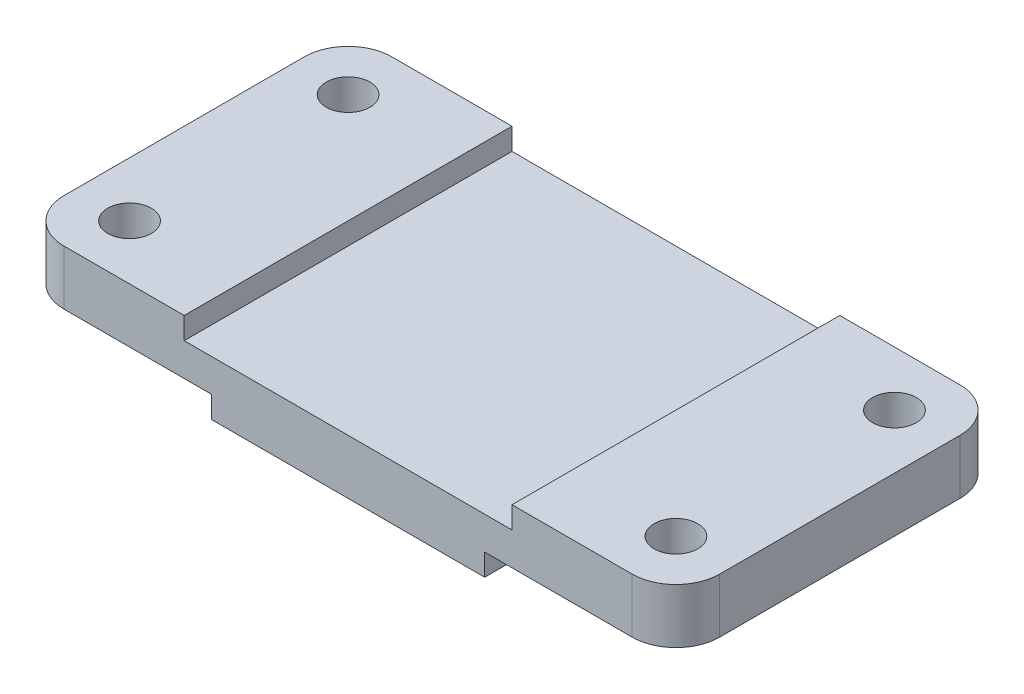
ISO-10303-21;
HEADER;
FILE_DESCRIPTION(('STEP AP214'),'2;1');
FILE_NAME('part.step','',(''),(''),'','','');
FILE_SCHEMA(('AUTOMOTIVE_DESIGN { 1 0 10303 214 1 1 1 1 }'));
ENDSEC;
DATA;
#1=APPLICATION_CONTEXT('core data for automotive mechanical design processes');
#2=APPLICATION_PROTOCOL_DEFINITION('international standard','automotive_design',2000,#1);
#3=PRODUCT_CONTEXT('',#1,'mechanical');
#4=PRODUCT('Part','Part','',(#3));
#5=PRODUCT_RELATED_PRODUCT_CATEGORY('part','',(#4));
#6=PRODUCT_DEFINITION_FORMATION('','',#4);
#7=PRODUCT_DEFINITION_CONTEXT('part definition',#1,'design');
#8=PRODUCT_DEFINITION('design','',#6,#7);
#9=PRODUCT_DEFINITION_SHAPE('','',#8);
#10=(LENGTH_UNIT() NAMED_UNIT(*) SI_UNIT(.MILLI.,.METRE.));
#11=(NAMED_UNIT(*) PLANE_ANGLE_UNIT() SI_UNIT($,.RADIAN.));
#12=(NAMED_UNIT(*) SI_UNIT($,.STERADIAN.) SOLID_ANGLE_UNIT());
#13=UNCERTAINTY_MEASURE_WITH_UNIT(LENGTH_MEASURE(1.E-05),#10,'distance_accuracy_value','');
#14=(GEOMETRIC_REPRESENTATION_CONTEXT(3) GLOBAL_UNCERTAINTY_ASSIGNED_CONTEXT((#13)) GLOBAL_UNIT_ASSIGNED_CONTEXT((#10,
#11,#12)) REPRESENTATION_CONTEXT('',''));
#15=CARTESIAN_POINT('',(0.,0.,0.));
#16=DIRECTION('',(0.,0.,1.));
#17=DIRECTION('',(1.,0.,0.));
#18=AXIS2_PLACEMENT_3D('',#15,#16,#17);
#19=CARTESIAN_POINT('',(0.,0.,0.));
#20=DIRECTION('',(0.,-1.,0.));
#21=DIRECTION('',(0.,0.,-1.));
#22=AXIS2_PLACEMENT_3D('',#19,#20,#21);
#23=PLANE('',#22);
#24=CARTESIAN_POINT('',(69.85,0.,-6.35));
#25=DIRECTION('',(0.,-1.,0.));
#26=DIRECTION('',(0.,0.,-1.));
#27=AXIS2_PLACEMENT_3D('',#24,#25,#26);
#28=CIRCLE('',#27,2.54);
#29=CARTESIAN_POINT('',(69.85,0.,-8.89));
#30=VERTEX_POINT('',#29);
#31=EDGE_CURVE('E308',#30,#30,#28,.T.);
#32=ORIENTED_EDGE('',*,*,#31,.F.);
#33=EDGE_LOOP('',(#32));
#34=FACE_BOUND('',#33,.T.);
#35=CARTESIAN_POINT('',(69.85,0.,-31.75));
#36=DIRECTION('',(0.,-1.,0.));
#37=DIRECTION('',(0.,0.,-1.));
#38=AXIS2_PLACEMENT_3D('',#35,#36,#37);
#39=CIRCLE('',#38,2.54);
#40=CARTESIAN_POINT('',(69.85,0.,-34.29));
#41=VERTEX_POINT('',#40);
#42=EDGE_CURVE('E312',#41,#41,#39,.T.);
#43=ORIENTED_EDGE('',*,*,#42,.F.);
#44=EDGE_LOOP('',(#43));
#45=FACE_BOUND('',#44,.T.);
#46=DIRECTION('',(0.,0.,-1.));
#47=VECTOR('',#46,1.);
#48=CARTESIAN_POINT('',(76.2,0.,-38.1));
#49=LINE('',#48,#47);
#50=CARTESIAN_POINT('',(76.2,0.,-5.08000000000002));
#51=VERTEX_POINT('',#50);
#52=CARTESIAN_POINT('',(76.2,0.,-33.02));
#53=VERTEX_POINT('',#52);
#54=EDGE_CURVE('E219',#51,#53,#49,.T.);
#55=ORIENTED_EDGE('',*,*,#54,.F.);
#56=CARTESIAN_POINT('',(71.12,0.,-5.08000000000001));
#57=DIRECTION('',(0.,-1.,0.));
#58=DIRECTION('',(0.,0.,-1.));
#59=AXIS2_PLACEMENT_3D('',#56,#57,#58);
#60=CIRCLE('',#59,5.08);
#61=CARTESIAN_POINT('',(71.12,0.,0.));
#62=VERTEX_POINT('',#61);
#63=EDGE_CURVE('E267',#51,#62,#60,.T.);
#64=ORIENTED_EDGE('',*,*,#63,.T.);
#65=DIRECTION('',(1.,0.,0.));
#66=VECTOR('',#65,1.);
#67=CARTESIAN_POINT('',(76.2,0.,0.));
#68=LINE('',#67,#66);
#69=CARTESIAN_POINT('',(53.975,0.,0.));
#70=VERTEX_POINT('',#69);
#71=EDGE_CURVE('E287',#70,#62,#68,.T.);
#72=ORIENTED_EDGE('',*,*,#71,.F.);
#73=DIRECTION('',(0.,0.,1.));
#74=VECTOR('',#73,1.);
#75=CARTESIAN_POINT('',(53.975,0.,-38.1));
#76=LINE('',#75,#74);
#77=CARTESIAN_POINT('',(53.975,0.,-38.1));
#78=VERTEX_POINT('',#77);
#79=EDGE_CURVE('E166',#78,#70,#76,.T.);
#80=ORIENTED_EDGE('',*,*,#79,.F.);
#81=DIRECTION('',(-1.,0.,0.));
#82=VECTOR('',#81,1.);
#83=CARTESIAN_POINT('',(0.,0.,-38.1));
#84=LINE('',#83,#82);
#85=CARTESIAN_POINT('',(71.12,0.,-38.1));
#86=VERTEX_POINT('',#85);
#87=EDGE_CURVE('E243',#86,#78,#84,.T.);
#88=ORIENTED_EDGE('',*,*,#87,.F.);
#89=CARTESIAN_POINT('',(71.12,0.,-33.02));
#90=DIRECTION('',(0.,-1.,0.));
#91=DIRECTION('',(0.,0.,-1.));
#92=AXIS2_PLACEMENT_3D('',#89,#90,#91);
#93=CIRCLE('',#92,5.08);
#94=EDGE_CURVE('E265',#86,#53,#93,.T.);
#95=ORIENTED_EDGE('',*,*,#94,.T.);
#96=EDGE_LOOP('',(#55,#64,#72,#80,#88,#95));
#97=FACE_BOUND('',#96,.T.);
#98=ADVANCED_FACE('F33',(#34,#45,#97),#23,.T.);
#99=CARTESIAN_POINT('',(0.,6.35,-38.1));
#100=DIRECTION('',(0.,0.,1.));
#101=DIRECTION('',(1.,0.,0.));
#102=AXIS2_PLACEMENT_3D('',#99,#100,#101);
#103=PLANE('',#102);
#104=CARTESIAN_POINT('',(22.225,0.,-38.1));
#105=VERTEX_POINT('',#104);
#106=CARTESIAN_POINT('',(5.08,0.,-38.1));
#107=VERTEX_POINT('',#106);
#108=EDGE_CURVE('E233',#105,#107,#84,.T.);
#109=ORIENTED_EDGE('',*,*,#108,.T.);
#110=DIRECTION('',(0.,-1.,0.));
#111=VECTOR('',#110,1.);
#112=CARTESIAN_POINT('',(5.08,6.35,-38.1));
#113=LINE('',#112,#111);
#114=CARTESIAN_POINT('',(5.08,6.35,-38.1));
#115=VERTEX_POINT('',#114);
#116=EDGE_CURVE('E251',#107,#115,#113,.F.);
#117=ORIENTED_EDGE('',*,*,#116,.T.);
#118=DIRECTION('',(-1.,0.,0.));
#119=VECTOR('',#118,1.);
#120=CARTESIAN_POINT('',(0.,6.35,-38.1));
#121=LINE('',#120,#119);
#122=CARTESIAN_POINT('',(19.05,6.35,-38.1));
#123=VERTEX_POINT('',#122);
#124=EDGE_CURVE('E222',#123,#115,#121,.T.);
#125=ORIENTED_EDGE('',*,*,#124,.F.);
#126=DIRECTION('',(0.,1.,0.));
#127=VECTOR('',#126,1.);
#128=CARTESIAN_POINT('',(19.05,3.81,-38.1));
#129=LINE('',#128,#127);
#130=CARTESIAN_POINT('',(19.05,3.81,-38.1));
#131=VERTEX_POINT('',#130);
#132=EDGE_CURVE('E214',#131,#123,#129,.T.);
#133=ORIENTED_EDGE('',*,*,#132,.F.);
#134=DIRECTION('',(1.,0.,0.));
#135=VECTOR('',#134,1.);
#136=CARTESIAN_POINT('',(19.05,3.81,-38.1));
#137=LINE('',#136,#135);
#138=CARTESIAN_POINT('',(57.15,3.81,-38.1));
#139=VERTEX_POINT('',#138);
#140=EDGE_CURVE('E202',#131,#139,#137,.T.);
#141=ORIENTED_EDGE('',*,*,#140,.T.);
#142=DIRECTION('',(0.,1.,0.));
#143=VECTOR('',#142,1.);
#144=CARTESIAN_POINT('',(57.15,3.81,-38.1));
#145=LINE('',#144,#143);
#146=CARTESIAN_POINT('',(57.15,6.35,-38.1));
#147=VERTEX_POINT('',#146);
#148=EDGE_CURVE('E211',#139,#147,#145,.T.);
#149=ORIENTED_EDGE('',*,*,#148,.T.);
#150=CARTESIAN_POINT('',(71.12,6.35,-38.1));
#151=VERTEX_POINT('',#150);
#152=EDGE_CURVE('E223',#151,#147,#121,.T.);
#153=ORIENTED_EDGE('',*,*,#152,.F.);
#154=DIRECTION('',(0.,-1.,0.));
#155=VECTOR('',#154,1.);
#156=CARTESIAN_POINT('',(71.12,6.35,-38.1));
#157=LINE('',#156,#155);
#158=EDGE_CURVE('E248',#151,#86,#157,.T.);
#159=ORIENTED_EDGE('',*,*,#158,.T.);
#160=ORIENTED_EDGE('',*,*,#87,.T.);
#161=DIRECTION('',(0.,1.,0.));
#162=VECTOR('',#161,1.);
#163=CARTESIAN_POINT('',(53.975,-2.54,-38.1));
#164=LINE('',#163,#162);
#165=CARTESIAN_POINT('',(53.975,-2.54,-38.1));
#166=VERTEX_POINT('',#165);
#167=EDGE_CURVE('E179',#166,#78,#164,.T.);
#168=ORIENTED_EDGE('',*,*,#167,.F.);
#169=DIRECTION('',(1.,0.,0.));
#170=VECTOR('',#169,1.);
#171=CARTESIAN_POINT('',(22.225,-2.54,-38.1));
#172=LINE('',#171,#170);
#173=CARTESIAN_POINT('',(22.225,-2.54,-38.1));
#174=VERTEX_POINT('',#173);
#175=EDGE_CURVE('E156',#174,#166,#172,.T.);
#176=ORIENTED_EDGE('',*,*,#175,.F.);
#177=DIRECTION('',(0.,1.,0.));
#178=VECTOR('',#177,1.);
#179=CARTESIAN_POINT('',(22.225,-2.54,-38.1));
#180=LINE('',#179,#178);
#181=EDGE_CURVE('E153',#174,#105,#180,.T.);
#182=ORIENTED_EDGE('',*,*,#181,.T.);
#183=EDGE_LOOP('',(#109,#117,#125,#133,#141,#149,#153,#159,#160,#168,#176,#182));
#184=FACE_BOUND('',#183,.T.);
#185=ADVANCED_FACE('F276',(#184),#103,.F.);
#186=CARTESIAN_POINT('',(76.2,6.35,0.));
#187=DIRECTION('',(0.,0.,-1.));
#188=DIRECTION('',(-1.,0.,0.));
#189=AXIS2_PLACEMENT_3D('',#186,#187,#188);
#190=PLANE('',#189);
#191=DIRECTION('',(1.,0.,0.));
#192=VECTOR('',#191,1.);
#193=CARTESIAN_POINT('',(76.2,6.35,0.));
#194=LINE('',#193,#192);
#195=CARTESIAN_POINT('',(5.08000000000003,6.35,0.));
#196=VERTEX_POINT('',#195);
#197=CARTESIAN_POINT('',(19.05,6.35,0.));
#198=VERTEX_POINT('',#197);
#199=EDGE_CURVE('E229',#196,#198,#194,.T.);
#200=ORIENTED_EDGE('',*,*,#199,.F.);
#201=DIRECTION('',(0.,-1.,0.));
#202=VECTOR('',#201,1.);
#203=CARTESIAN_POINT('',(5.08,6.35,0.));
#204=LINE('',#203,#202);
#205=CARTESIAN_POINT('',(5.08000000000003,0.,0.));
#206=VERTEX_POINT('',#205);
#207=EDGE_CURVE('E259',#196,#206,#204,.T.);
#208=ORIENTED_EDGE('',*,*,#207,.T.);
#209=CARTESIAN_POINT('',(22.225,0.,0.));
#210=VERTEX_POINT('',#209);
#211=EDGE_CURVE('E172',#206,#210,#68,.T.);
#212=ORIENTED_EDGE('',*,*,#211,.T.);
#213=DIRECTION('',(0.,1.,0.));
#214=VECTOR('',#213,1.);
#215=CARTESIAN_POINT('',(22.225,-2.54,0.));
#216=LINE('',#215,#214);
#217=CARTESIAN_POINT('',(22.225,-2.54,0.));
#218=VERTEX_POINT('',#217);
#219=EDGE_CURVE('E151',#218,#210,#216,.T.);
#220=ORIENTED_EDGE('',*,*,#219,.F.);
#221=DIRECTION('',(-1.,0.,0.));
#222=VECTOR('',#221,1.);
#223=CARTESIAN_POINT('',(53.975,-2.54,0.));
#224=LINE('',#223,#222);
#225=CARTESIAN_POINT('',(53.975,-2.54,0.));
#226=VERTEX_POINT('',#225);
#227=EDGE_CURVE('E157',#226,#218,#224,.T.);
#228=ORIENTED_EDGE('',*,*,#227,.F.);
#229=DIRECTION('',(0.,1.,0.));
#230=VECTOR('',#229,1.);
#231=CARTESIAN_POINT('',(53.975,-2.54,0.));
#232=LINE('',#231,#230);
#233=EDGE_CURVE('E190',#226,#70,#232,.T.);
#234=ORIENTED_EDGE('',*,*,#233,.T.);
#235=ORIENTED_EDGE('',*,*,#71,.T.);
#236=DIRECTION('',(0.,-1.,0.));
#237=VECTOR('',#236,1.);
#238=CARTESIAN_POINT('',(71.12,6.35,0.));
#239=LINE('',#238,#237);
#240=CARTESIAN_POINT('',(71.12,6.35,0.));
#241=VERTEX_POINT('',#240);
#242=EDGE_CURVE('E257',#62,#241,#239,.F.);
#243=ORIENTED_EDGE('',*,*,#242,.T.);
#244=CARTESIAN_POINT('',(57.15,6.35,0.));
#245=VERTEX_POINT('',#244);
#246=EDGE_CURVE('E228',#245,#241,#194,.T.);
#247=ORIENTED_EDGE('',*,*,#246,.F.);
#248=DIRECTION('',(0.,1.,0.));
#249=VECTOR('',#248,1.);
#250=CARTESIAN_POINT('',(57.15,3.81,0.));
#251=LINE('',#250,#249);
#252=CARTESIAN_POINT('',(57.15,3.81,0.));
#253=VERTEX_POINT('',#252);
#254=EDGE_CURVE('E206',#253,#245,#251,.T.);
#255=ORIENTED_EDGE('',*,*,#254,.F.);
#256=DIRECTION('',(-1.,0.,0.));
#257=VECTOR('',#256,1.);
#258=CARTESIAN_POINT('',(57.15,3.81,0.));
#259=LINE('',#258,#257);
#260=CARTESIAN_POINT('',(19.05,3.81,0.));
#261=VERTEX_POINT('',#260);
#262=EDGE_CURVE('E197',#253,#261,#259,.T.);
#263=ORIENTED_EDGE('',*,*,#262,.T.);
#264=DIRECTION('',(0.,1.,0.));
#265=VECTOR('',#264,1.);
#266=CARTESIAN_POINT('',(19.05,3.81,0.));
#267=LINE('',#266,#265);
#268=EDGE_CURVE('E216',#261,#198,#267,.T.);
#269=ORIENTED_EDGE('',*,*,#268,.T.);
#270=EDGE_LOOP('',(#200,#208,#212,#220,#228,#234,#235,#243,#247,#255,#263,#269));
#271=FACE_BOUND('',#270,.T.);
#272=ADVANCED_FACE('F169',(#271),#190,.F.);
#273=CARTESIAN_POINT('',(0.,6.35,0.));
#274=DIRECTION('',(0.,-1.,0.));
#275=DIRECTION('',(0.,0.,-1.));
#276=AXIS2_PLACEMENT_3D('',#273,#274,#275);
#277=PLANE('',#276);
#278=CARTESIAN_POINT('',(6.35,6.35,-6.35));
#279=DIRECTION('',(0.,-1.,0.));
#280=DIRECTION('',(0.,0.,-1.));
#281=AXIS2_PLACEMENT_3D('',#278,#279,#280);
#282=CIRCLE('',#281,2.54);
#283=CARTESIAN_POINT('',(6.35,6.35,-8.89));
#284=VERTEX_POINT('',#283);
#285=EDGE_CURVE('E316',#284,#284,#282,.T.);
#286=ORIENTED_EDGE('',*,*,#285,.T.);
#287=EDGE_LOOP('',(#286));
#288=FACE_BOUND('',#287,.T.);
#289=CARTESIAN_POINT('',(6.35,6.35,-31.75));
#290=DIRECTION('',(0.,-1.,0.));
#291=DIRECTION('',(0.,0.,-1.));
#292=AXIS2_PLACEMENT_3D('',#289,#290,#291);
#293=CIRCLE('',#292,2.54);
#294=CARTESIAN_POINT('',(6.35,6.35,-34.29));
#295=VERTEX_POINT('',#294);
#296=EDGE_CURVE('E320',#295,#295,#293,.T.);
#297=ORIENTED_EDGE('',*,*,#296,.T.);
#298=EDGE_LOOP('',(#297));
#299=FACE_BOUND('',#298,.T.);
#300=ORIENTED_EDGE('',*,*,#124,.T.);
#301=CARTESIAN_POINT('',(5.08,6.35,-33.02));
#302=DIRECTION('',(0.,-1.,0.));
#303=DIRECTION('',(0.,0.,-1.));
#304=AXIS2_PLACEMENT_3D('',#301,#302,#303);
#305=CIRCLE('',#304,5.08);
#306=CARTESIAN_POINT('',(0.,6.35,-33.02));
#307=VERTEX_POINT('',#306);
#308=EDGE_CURVE('E255',#115,#307,#305,.F.);
#309=ORIENTED_EDGE('',*,*,#308,.T.);
#310=DIRECTION('',(0.,0.,1.));
#311=VECTOR('',#310,1.);
#312=CARTESIAN_POINT('',(0.,6.35,0.));
#313=LINE('',#312,#311);
#314=CARTESIAN_POINT('',(0.,6.35,-5.08));
#315=VERTEX_POINT('',#314);
#316=EDGE_CURVE('E225',#307,#315,#313,.T.);
#317=ORIENTED_EDGE('',*,*,#316,.T.);
#318=CARTESIAN_POINT('',(5.08,6.35,-5.08));
#319=DIRECTION('',(0.,-1.,0.));
#320=DIRECTION('',(0.,0.,-1.));
#321=AXIS2_PLACEMENT_3D('',#318,#319,#320);
#322=CIRCLE('',#321,5.08);
#323=EDGE_CURVE('E253',#315,#196,#322,.F.);
#324=ORIENTED_EDGE('',*,*,#323,.T.);
#325=ORIENTED_EDGE('',*,*,#199,.T.);
#326=DIRECTION('',(0.,0.,-1.));
#327=VECTOR('',#326,1.);
#328=CARTESIAN_POINT('',(19.05,6.35,0.));
#329=LINE('',#328,#327);
#330=EDGE_CURVE('E174',#198,#123,#329,.T.);
#331=ORIENTED_EDGE('',*,*,#330,.T.);
#332=EDGE_LOOP('',(#300,#309,#317,#324,#325,#331));
#333=FACE_BOUND('',#332,.T.);
#334=ADVANCED_FACE('F355',(#288,#299,#333),#277,.F.);
#335=CARTESIAN_POINT('',(69.85,6.35,-6.35));
#336=DIRECTION('',(0.,-1.,0.));
#337=DIRECTION('',(0.,0.,-1.));
#338=AXIS2_PLACEMENT_3D('',#335,#336,#337);
#339=CIRCLE('',#338,2.54);
#340=CARTESIAN_POINT('',(69.85,6.35,-8.89));
#341=VERTEX_POINT('',#340);
#342=EDGE_CURVE('E305',#341,#341,#339,.T.);
#343=ORIENTED_EDGE('',*,*,#342,.T.);
#344=EDGE_LOOP('',(#343));
#345=FACE_BOUND('',#344,.T.);
#346=CARTESIAN_POINT('',(69.85,6.35,-31.75));
#347=DIRECTION('',(0.,-1.,0.));
#348=DIRECTION('',(0.,0.,-1.));
#349=AXIS2_PLACEMENT_3D('',#346,#347,#348);
#350=CIRCLE('',#349,2.54);
#351=CARTESIAN_POINT('',(69.85,6.35,-34.29));
#352=VERTEX_POINT('',#351);
#353=EDGE_CURVE('E309',#352,#352,#350,.T.);
#354=ORIENTED_EDGE('',*,*,#353,.T.);
#355=EDGE_LOOP('',(#354));
#356=FACE_BOUND('',#355,.T.);
#357=ORIENTED_EDGE('',*,*,#246,.T.);
#358=CARTESIAN_POINT('',(71.12,6.35,-5.08000000000001));
#359=DIRECTION('',(0.,-1.,0.));
#360=DIRECTION('',(0.,0.,-1.));
#361=AXIS2_PLACEMENT_3D('',#358,#359,#360);
#362=CIRCLE('',#361,5.08);
#363=CARTESIAN_POINT('',(76.2,6.35,-5.08000000000002));
#364=VERTEX_POINT('',#363);
#365=EDGE_CURVE('E11',#241,#364,#362,.F.);
#366=ORIENTED_EDGE('',*,*,#365,.T.);
#367=DIRECTION('',(0.,0.,-1.));
#368=VECTOR('',#367,1.);
#369=CARTESIAN_POINT('',(76.2,6.35,-38.1));
#370=LINE('',#369,#368);
#371=CARTESIAN_POINT('',(76.2,6.35,-33.02));
#372=VERTEX_POINT('',#371);
#373=EDGE_CURVE('E220',#364,#372,#370,.T.);
#374=ORIENTED_EDGE('',*,*,#373,.T.);
#375=CARTESIAN_POINT('',(71.12,6.35,-33.02));
#376=DIRECTION('',(0.,-1.,0.));
#377=DIRECTION('',(0.,0.,-1.));
#378=AXIS2_PLACEMENT_3D('',#375,#376,#377);
#379=CIRCLE('',#378,5.08);
#380=EDGE_CURVE('E41',#372,#151,#379,.F.);
#381=ORIENTED_EDGE('',*,*,#380,.T.);
#382=ORIENTED_EDGE('',*,*,#152,.T.);
#383=DIRECTION('',(0.,0.,1.));
#384=VECTOR('',#383,1.);
#385=CARTESIAN_POINT('',(57.15,6.35,-38.1));
#386=LINE('',#385,#384);
#387=EDGE_CURVE('E177',#147,#245,#386,.T.);
#388=ORIENTED_EDGE('',*,*,#387,.T.);
#389=EDGE_LOOP('',(#357,#366,#374,#381,#382,#388));
#390=FACE_BOUND('',#389,.T.);
#391=ADVANCED_FACE('F270',(#345,#356,#390),#277,.F.);
#392=CARTESIAN_POINT('',(76.2,6.35,-38.1));
#393=DIRECTION('',(-1.,0.,0.));
#394=DIRECTION('',(0.,0.,1.));
#395=AXIS2_PLACEMENT_3D('',#392,#393,#394);
#396=PLANE('',#395);
#397=ORIENTED_EDGE('',*,*,#373,.F.);
#398=DIRECTION('',(0.,-1.,0.));
#399=VECTOR('',#398,1.);
#400=CARTESIAN_POINT('',(76.2,6.35,-5.08000000000001));
#401=LINE('',#400,#399);
#402=EDGE_CURVE('E262',#364,#51,#401,.T.);
#403=ORIENTED_EDGE('',*,*,#402,.T.);
#404=ORIENTED_EDGE('',*,*,#54,.T.);
#405=DIRECTION('',(0.,-1.,0.));
#406=VECTOR('',#405,1.);
#407=CARTESIAN_POINT('',(76.2,6.35,-33.02));
#408=LINE('',#407,#406);
#409=EDGE_CURVE('E48',#53,#372,#408,.F.);
#410=ORIENTED_EDGE('',*,*,#409,.T.);
#411=EDGE_LOOP('',(#397,#403,#404,#410));
#412=FACE_BOUND('',#411,.T.);
#413=ADVANCED_FACE('F281',(#412),#396,.F.);
#414=CARTESIAN_POINT('',(0.,6.35,0.));
#415=DIRECTION('',(1.,0.,0.));
#416=DIRECTION('',(0.,0.,-1.));
#417=AXIS2_PLACEMENT_3D('',#414,#415,#416);
#418=PLANE('',#417);
#419=ORIENTED_EDGE('',*,*,#316,.F.);
#420=DIRECTION('',(0.,-1.,0.));
#421=VECTOR('',#420,1.);
#422=CARTESIAN_POINT('',(0.,6.35,-33.02));
#423=LINE('',#422,#421);
#424=CARTESIAN_POINT('',(0.,0.,-33.02));
#425=VERTEX_POINT('',#424);
#426=EDGE_CURVE('E294',#307,#425,#423,.T.);
#427=ORIENTED_EDGE('',*,*,#426,.T.);
#428=DIRECTION('',(0.,0.,1.));
#429=VECTOR('',#428,1.);
#430=CARTESIAN_POINT('',(0.,0.,0.));
#431=LINE('',#430,#429);
#432=CARTESIAN_POINT('',(0.,0.,-5.08));
#433=VERTEX_POINT('',#432);
#434=EDGE_CURVE('E236',#425,#433,#431,.T.);
#435=ORIENTED_EDGE('',*,*,#434,.T.);
#436=DIRECTION('',(0.,-1.,0.));
#437=VECTOR('',#436,1.);
#438=CARTESIAN_POINT('',(0.,6.35,-5.08));
#439=LINE('',#438,#437);
#440=EDGE_CURVE('E231',#433,#315,#439,.F.);
#441=ORIENTED_EDGE('',*,*,#440,.T.);
#442=EDGE_LOOP('',(#419,#427,#435,#441));
#443=FACE_BOUND('',#442,.T.);
#444=ADVANCED_FACE('F362',(#443),#418,.F.);
#445=CARTESIAN_POINT('',(6.35,0.,-6.35));
#446=DIRECTION('',(0.,-1.,0.));
#447=DIRECTION('',(0.,0.,-1.));
#448=AXIS2_PLACEMENT_3D('',#445,#446,#447);
#449=CIRCLE('',#448,2.54);
#450=CARTESIAN_POINT('',(6.35,0.,-8.89));
#451=VERTEX_POINT('',#450);
#452=EDGE_CURVE('E313',#451,#451,#449,.T.);
#453=ORIENTED_EDGE('',*,*,#452,.F.);
#454=EDGE_LOOP('',(#453));
#455=FACE_BOUND('',#454,.T.);
#456=CARTESIAN_POINT('',(6.35,0.,-31.75));
#457=DIRECTION('',(0.,-1.,0.));
#458=DIRECTION('',(0.,0.,-1.));
#459=AXIS2_PLACEMENT_3D('',#456,#457,#458);
#460=CIRCLE('',#459,2.54);
#461=CARTESIAN_POINT('',(6.35,0.,-34.29));
#462=VERTEX_POINT('',#461);
#463=EDGE_CURVE('E317',#462,#462,#460,.T.);
#464=ORIENTED_EDGE('',*,*,#463,.F.);
#465=EDGE_LOOP('',(#464));
#466=FACE_BOUND('',#465,.T.);
#467=ORIENTED_EDGE('',*,*,#434,.F.);
#468=CARTESIAN_POINT('',(5.08,0.,-33.02));
#469=DIRECTION('',(0.,-1.,0.));
#470=DIRECTION('',(0.,0.,-1.));
#471=AXIS2_PLACEMENT_3D('',#468,#469,#470);
#472=CIRCLE('',#471,5.08);
#473=EDGE_CURVE('E246',#425,#107,#472,.T.);
#474=ORIENTED_EDGE('',*,*,#473,.T.);
#475=ORIENTED_EDGE('',*,*,#108,.F.);
#476=DIRECTION('',(0.,0.,-1.));
#477=VECTOR('',#476,1.);
#478=CARTESIAN_POINT('',(22.225,0.,0.));
#479=LINE('',#478,#477);
#480=EDGE_CURVE('E189',#210,#105,#479,.T.);
#481=ORIENTED_EDGE('',*,*,#480,.F.);
#482=ORIENTED_EDGE('',*,*,#211,.F.);
#483=CARTESIAN_POINT('',(5.08,0.,-5.08));
#484=DIRECTION('',(0.,-1.,0.));
#485=DIRECTION('',(0.,0.,-1.));
#486=AXIS2_PLACEMENT_3D('',#483,#484,#485);
#487=CIRCLE('',#486,5.08);
#488=EDGE_CURVE('E296',#206,#433,#487,.T.);
#489=ORIENTED_EDGE('',*,*,#488,.T.);
#490=EDGE_LOOP('',(#467,#474,#475,#481,#482,#489));
#491=FACE_BOUND('',#490,.T.);
#492=ADVANCED_FACE('F344',(#455,#466,#491),#23,.T.);
#493=CARTESIAN_POINT('',(19.05,3.81,0.));
#494=DIRECTION('',(1.,0.,0.));
#495=DIRECTION('',(0.,0.,-1.));
#496=AXIS2_PLACEMENT_3D('',#493,#494,#495);
#497=PLANE('',#496);
#498=ORIENTED_EDGE('',*,*,#330,.F.);
#499=ORIENTED_EDGE('',*,*,#268,.F.);
#500=DIRECTION('',(0.,0.,-1.));
#501=VECTOR('',#500,1.);
#502=CARTESIAN_POINT('',(19.05,3.81,0.));
#503=LINE('',#502,#501);
#504=EDGE_CURVE('E200',#261,#131,#503,.T.);
#505=ORIENTED_EDGE('',*,*,#504,.T.);
#506=ORIENTED_EDGE('',*,*,#132,.T.);
#507=EDGE_LOOP('',(#498,#499,#505,#506));
#508=FACE_BOUND('',#507,.T.);
#509=ADVANCED_FACE('F366',(#508),#497,.T.);
#510=CARTESIAN_POINT('',(57.15,3.81,-38.1));
#511=DIRECTION('',(-1.,0.,0.));
#512=DIRECTION('',(0.,0.,1.));
#513=AXIS2_PLACEMENT_3D('',#510,#511,#512);
#514=PLANE('',#513);
#515=ORIENTED_EDGE('',*,*,#387,.F.);
#516=ORIENTED_EDGE('',*,*,#148,.F.);
#517=DIRECTION('',(0.,0.,1.));
#518=VECTOR('',#517,1.);
#519=CARTESIAN_POINT('',(57.15,3.81,-38.1));
#520=LINE('',#519,#518);
#521=EDGE_CURVE('E205',#139,#253,#520,.T.);
#522=ORIENTED_EDGE('',*,*,#521,.T.);
#523=ORIENTED_EDGE('',*,*,#254,.T.);
#524=EDGE_LOOP('',(#515,#516,#522,#523));
#525=FACE_BOUND('',#524,.T.);
#526=ADVANCED_FACE('F523',(#525),#514,.T.);
#527=CARTESIAN_POINT('',(0.,3.81,0.));
#528=DIRECTION('',(0.,-1.,0.));
#529=DIRECTION('',(0.,0.,-1.));
#530=AXIS2_PLACEMENT_3D('',#527,#528,#529);
#531=PLANE('',#530);
#532=ORIENTED_EDGE('',*,*,#262,.F.);
#533=ORIENTED_EDGE('',*,*,#521,.F.);
#534=ORIENTED_EDGE('',*,*,#140,.F.);
#535=ORIENTED_EDGE('',*,*,#504,.F.);
#536=EDGE_LOOP('',(#532,#533,#534,#535));
#537=FACE_BOUND('',#536,.T.);
#538=ADVANCED_FACE('F515',(#537),#531,.F.);
#539=CARTESIAN_POINT('',(22.225,-2.54,0.));
#540=DIRECTION('',(1.,0.,0.));
#541=DIRECTION('',(0.,0.,-1.));
#542=AXIS2_PLACEMENT_3D('',#539,#540,#541);
#543=PLANE('',#542);
#544=ORIENTED_EDGE('',*,*,#480,.T.);
#545=ORIENTED_EDGE('',*,*,#181,.F.);
#546=DIRECTION('',(0.,0.,-1.));
#547=VECTOR('',#546,1.);
#548=CARTESIAN_POINT('',(22.225,-2.54,0.));
#549=LINE('',#548,#547);
#550=EDGE_CURVE('E146',#218,#174,#549,.T.);
#551=ORIENTED_EDGE('',*,*,#550,.F.);
#552=ORIENTED_EDGE('',*,*,#219,.T.);
#553=EDGE_LOOP('',(#544,#545,#551,#552));
#554=FACE_BOUND('',#553,.T.);
#555=ADVANCED_FACE('F149',(#554),#543,.F.);
#556=CARTESIAN_POINT('',(53.975,-2.54,-38.1));
#557=DIRECTION('',(-1.,0.,0.));
#558=DIRECTION('',(0.,0.,1.));
#559=AXIS2_PLACEMENT_3D('',#556,#557,#558);
#560=PLANE('',#559);
#561=ORIENTED_EDGE('',*,*,#79,.T.);
#562=ORIENTED_EDGE('',*,*,#233,.F.);
#563=DIRECTION('',(0.,0.,1.));
#564=VECTOR('',#563,1.);
#565=CARTESIAN_POINT('',(53.975,-2.54,-38.1));
#566=LINE('',#565,#564);
#567=EDGE_CURVE('E162',#166,#226,#566,.T.);
#568=ORIENTED_EDGE('',*,*,#567,.F.);
#569=ORIENTED_EDGE('',*,*,#167,.T.);
#570=EDGE_LOOP('',(#561,#562,#568,#569));
#571=FACE_BOUND('',#570,.T.);
#572=ADVANCED_FACE('F499',(#571),#560,.F.);
#573=CARTESIAN_POINT('',(0.,-2.54,0.));
#574=DIRECTION('',(0.,-1.,0.));
#575=DIRECTION('',(0.,0.,-1.));
#576=AXIS2_PLACEMENT_3D('',#573,#574,#575);
#577=PLANE('',#576);
#578=ORIENTED_EDGE('',*,*,#227,.T.);
#579=ORIENTED_EDGE('',*,*,#550,.T.);
#580=ORIENTED_EDGE('',*,*,#175,.T.);
#581=ORIENTED_EDGE('',*,*,#567,.T.);
#582=EDGE_LOOP('',(#578,#579,#580,#581));
#583=FACE_BOUND('',#582,.T.);
#584=ADVANCED_FACE('F160',(#583),#577,.T.);
#585=CARTESIAN_POINT('',(6.35,-2.54,-31.75));
#586=DIRECTION('',(0.,1.,0.));
#587=DIRECTION('',(0.,0.,1.));
#588=AXIS2_PLACEMENT_3D('',#585,#586,#587);
#589=CYLINDRICAL_SURFACE('',#588,2.54);
#590=ORIENTED_EDGE('',*,*,#463,.T.);
#591=EDGE_LOOP('',(#590));
#592=FACE_BOUND('',#591,.T.);
#593=ORIENTED_EDGE('',*,*,#296,.F.);
#594=EDGE_LOOP('',(#593));
#595=FACE_BOUND('',#594,.T.);
#596=ADVANCED_FACE('F480',(#592,#595),#589,.F.);
#597=CARTESIAN_POINT('',(6.35,-2.54,-6.35));
#598=DIRECTION('',(0.,1.,0.));
#599=DIRECTION('',(0.,0.,1.));
#600=AXIS2_PLACEMENT_3D('',#597,#598,#599);
#601=CYLINDRICAL_SURFACE('',#600,2.54);
#602=ORIENTED_EDGE('',*,*,#452,.T.);
#603=EDGE_LOOP('',(#602));
#604=FACE_BOUND('',#603,.T.);
#605=ORIENTED_EDGE('',*,*,#285,.F.);
#606=EDGE_LOOP('',(#605));
#607=FACE_BOUND('',#606,.T.);
#608=ADVANCED_FACE('F350',(#604,#607),#601,.F.);
#609=CARTESIAN_POINT('',(69.85,-2.54,-31.75));
#610=DIRECTION('',(0.,1.,0.));
#611=DIRECTION('',(0.,0.,1.));
#612=AXIS2_PLACEMENT_3D('',#609,#610,#611);
#613=CYLINDRICAL_SURFACE('',#612,2.54);
#614=ORIENTED_EDGE('',*,*,#42,.T.);
#615=EDGE_LOOP('',(#614));
#616=FACE_BOUND('',#615,.T.);
#617=ORIENTED_EDGE('',*,*,#353,.F.);
#618=EDGE_LOOP('',(#617));
#619=FACE_BOUND('',#618,.T.);
#620=ADVANCED_FACE('F347',(#616,#619),#613,.F.);
#621=CARTESIAN_POINT('',(69.85,-2.54,-6.35));
#622=DIRECTION('',(0.,1.,0.));
#623=DIRECTION('',(0.,0.,1.));
#624=AXIS2_PLACEMENT_3D('',#621,#622,#623);
#625=CYLINDRICAL_SURFACE('',#624,2.54);
#626=ORIENTED_EDGE('',*,*,#31,.T.);
#627=EDGE_LOOP('',(#626));
#628=FACE_BOUND('',#627,.T.);
#629=ORIENTED_EDGE('',*,*,#342,.F.);
#630=EDGE_LOOP('',(#629));
#631=FACE_BOUND('',#630,.T.);
#632=ADVANCED_FACE('F338',(#628,#631),#625,.F.);
#633=CARTESIAN_POINT('',(5.08,6.35,-33.02));
#634=DIRECTION('',(0.,-1.,0.));
#635=DIRECTION('',(0.,0.,-1.));
#636=AXIS2_PLACEMENT_3D('',#633,#634,#635);
#637=CYLINDRICAL_SURFACE('',#636,5.08);
#638=ORIENTED_EDGE('',*,*,#308,.F.);
#639=ORIENTED_EDGE('',*,*,#116,.F.);
#640=ORIENTED_EDGE('',*,*,#473,.F.);
#641=ORIENTED_EDGE('',*,*,#426,.F.);
#642=EDGE_LOOP('',(#638,#639,#640,#641));
#643=FACE_BOUND('',#642,.T.);
#644=ADVANCED_FACE('F377',(#643),#637,.T.);
#645=CARTESIAN_POINT('',(5.08,6.35,-5.08));
#646=DIRECTION('',(0.,-1.,0.));
#647=DIRECTION('',(0.,0.,-1.));
#648=AXIS2_PLACEMENT_3D('',#645,#646,#647);
#649=CYLINDRICAL_SURFACE('',#648,5.08);
#650=ORIENTED_EDGE('',*,*,#323,.F.);
#651=ORIENTED_EDGE('',*,*,#440,.F.);
#652=ORIENTED_EDGE('',*,*,#488,.F.);
#653=ORIENTED_EDGE('',*,*,#207,.F.);
#654=EDGE_LOOP('',(#650,#651,#652,#653));
#655=FACE_BOUND('',#654,.T.);
#656=ADVANCED_FACE('F380',(#655),#649,.T.);
#657=CARTESIAN_POINT('',(71.12,6.35,-5.08000000000001));
#658=DIRECTION('',(0.,-1.,0.));
#659=DIRECTION('',(0.,0.,-1.));
#660=AXIS2_PLACEMENT_3D('',#657,#658,#659);
#661=CYLINDRICAL_SURFACE('',#660,5.08);
#662=ORIENTED_EDGE('',*,*,#365,.F.);
#663=ORIENTED_EDGE('',*,*,#242,.F.);
#664=ORIENTED_EDGE('',*,*,#63,.F.);
#665=ORIENTED_EDGE('',*,*,#402,.F.);
#666=EDGE_LOOP('',(#662,#663,#664,#665));
#667=FACE_BOUND('',#666,.T.);
#668=ADVANCED_FACE('F284',(#667),#661,.T.);
#669=CARTESIAN_POINT('',(71.12,6.35,-33.02));
#670=DIRECTION('',(0.,-1.,0.));
#671=DIRECTION('',(0.,0.,-1.));
#672=AXIS2_PLACEMENT_3D('',#669,#670,#671);
#673=CYLINDRICAL_SURFACE('',#672,5.08);
#674=ORIENTED_EDGE('',*,*,#380,.F.);
#675=ORIENTED_EDGE('',*,*,#409,.F.);
#676=ORIENTED_EDGE('',*,*,#94,.F.);
#677=ORIENTED_EDGE('',*,*,#158,.F.);
#678=EDGE_LOOP('',(#674,#675,#676,#677));
#679=FACE_BOUND('',#678,.T.);
#680=ADVANCED_FACE('F35',(#679),#673,.T.);
#681=CLOSED_SHELL('',(#98,#185,#272,#334,#391,#413,#444,#492,#509,#526,#538,#555,#572,#584,#596,
#608,#620,#632,#644,#656,#668,#680));
#682=MANIFOLD_SOLID_BREP('B2',#681);
#683=ADVANCED_BREP_SHAPE_REPRESENTATION('',(#18,#682),#14);
#684=SHAPE_DEFINITION_REPRESENTATION(#9,#683);
ENDSEC;
END-ISO-10303-21;
